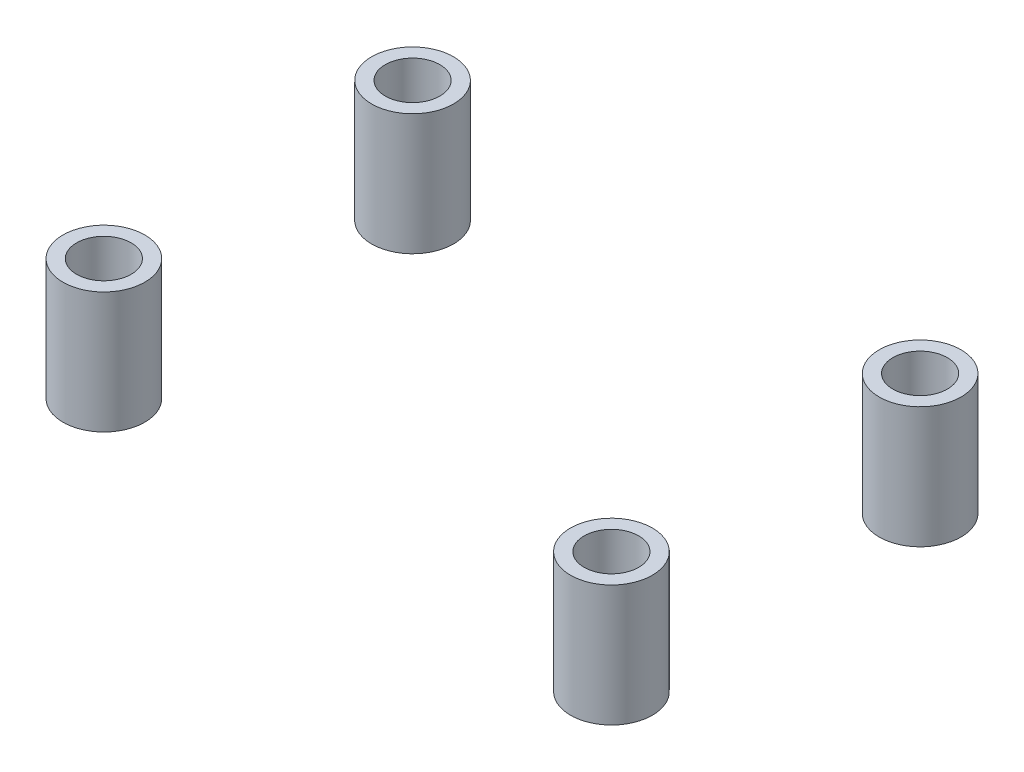
ISO-10303-21;
HEADER;
FILE_DESCRIPTION(('STEP AP214'),'2;1');
FILE_NAME('part.step','',(''),(''),'','','');
FILE_SCHEMA(('AUTOMOTIVE_DESIGN { 1 0 10303 214 1 1 1 1 }'));
ENDSEC;
DATA;
#1=APPLICATION_CONTEXT('core data for automotive mechanical design processes');
#2=APPLICATION_PROTOCOL_DEFINITION('international standard','automotive_design',2000,#1);
#3=PRODUCT_CONTEXT('',#1,'mechanical');
#4=PRODUCT('Part','Part','',(#3));
#5=PRODUCT_RELATED_PRODUCT_CATEGORY('part','',(#4));
#6=PRODUCT_DEFINITION_FORMATION('','',#4);
#7=PRODUCT_DEFINITION_CONTEXT('part definition',#1,'design');
#8=PRODUCT_DEFINITION('design','',#6,#7);
#9=PRODUCT_DEFINITION_SHAPE('','',#8);
#10=(LENGTH_UNIT() NAMED_UNIT(*) SI_UNIT(.MILLI.,.METRE.));
#11=(NAMED_UNIT(*) PLANE_ANGLE_UNIT() SI_UNIT($,.RADIAN.));
#12=(NAMED_UNIT(*) SI_UNIT($,.STERADIAN.) SOLID_ANGLE_UNIT());
#13=UNCERTAINTY_MEASURE_WITH_UNIT(LENGTH_MEASURE(1.E-05),#10,'distance_accuracy_value','');
#14=(GEOMETRIC_REPRESENTATION_CONTEXT(3) GLOBAL_UNCERTAINTY_ASSIGNED_CONTEXT((#13)) GLOBAL_UNIT_ASSIGNED_CONTEXT((#10,
#11,#12)) REPRESENTATION_CONTEXT('',''));
#15=CARTESIAN_POINT('',(0.,0.,0.));
#16=DIRECTION('',(0.,0.,1.));
#17=DIRECTION('',(1.,0.,0.));
#18=AXIS2_PLACEMENT_3D('',#15,#16,#17);
#19=CARTESIAN_POINT('',(18.5995078305466,8.89,11.3123872252951));
#20=DIRECTION('',(0.,-1.,0.));
#21=DIRECTION('',(0.,0.,1.));
#22=AXIS2_PLACEMENT_3D('',#19,#20,#21);
#23=CYLINDRICAL_SURFACE('',#22,3.);
#24=CARTESIAN_POINT('',(18.5995078305466,8.89,11.3123872252951));
#25=DIRECTION('',(0.,1.,0.));
#26=DIRECTION('',(0.,0.,-1.));
#27=AXIS2_PLACEMENT_3D('',#24,#25,#26);
#28=CIRCLE('',#27,3.);
#29=CARTESIAN_POINT('',(18.5995078305466,8.89,8.31238722529509));
#30=VERTEX_POINT('',#29);
#31=EDGE_CURVE('E59',#30,#30,#28,.T.);
#32=ORIENTED_EDGE('',*,*,#31,.F.);
#33=EDGE_LOOP('',(#32));
#34=FACE_BOUND('',#33,.T.);
#35=CARTESIAN_POINT('',(18.5995078305466,0.,11.3123872252951));
#36=DIRECTION('',(0.,1.,0.));
#37=DIRECTION('',(0.,0.,-1.));
#38=AXIS2_PLACEMENT_3D('',#35,#36,#37);
#39=CIRCLE('',#38,3.);
#40=CARTESIAN_POINT('',(18.5995078305466,0.,8.31238722529509));
#41=VERTEX_POINT('',#40);
#42=EDGE_CURVE('E65',#41,#41,#39,.T.);
#43=ORIENTED_EDGE('',*,*,#42,.T.);
#44=EDGE_LOOP('',(#43));
#45=FACE_BOUND('',#44,.T.);
#46=ADVANCED_FACE('F52',(#34,#45),#23,.T.);
#47=CARTESIAN_POINT('',(18.5995078305466,8.89,11.3123872252951));
#48=DIRECTION('',(0.,-1.,0.));
#49=DIRECTION('',(0.,0.,1.));
#50=AXIS2_PLACEMENT_3D('',#47,#48,#49);
#51=CYLINDRICAL_SURFACE('',#50,2.);
#52=CARTESIAN_POINT('',(18.5995078305466,8.89,11.3123872252951));
#53=DIRECTION('',(0.,1.,0.));
#54=DIRECTION('',(0.,0.,-1.));
#55=AXIS2_PLACEMENT_3D('',#52,#53,#54);
#56=CIRCLE('',#55,2.);
#57=CARTESIAN_POINT('',(18.5995078305466,8.89,9.31238722529509));
#58=VERTEX_POINT('',#57);
#59=EDGE_CURVE('E11',#58,#58,#56,.T.);
#60=ORIENTED_EDGE('',*,*,#59,.T.);
#61=EDGE_LOOP('',(#60));
#62=FACE_BOUND('',#61,.T.);
#63=CARTESIAN_POINT('',(18.5995078305466,0.,11.3123872252951));
#64=DIRECTION('',(0.,1.,0.));
#65=DIRECTION('',(0.,0.,-1.));
#66=AXIS2_PLACEMENT_3D('',#63,#64,#65);
#67=CIRCLE('',#66,2.);
#68=CARTESIAN_POINT('',(18.5995078305466,0.,9.31238722529509));
#69=VERTEX_POINT('',#68);
#70=EDGE_CURVE('E55',#69,#69,#67,.T.);
#71=ORIENTED_EDGE('',*,*,#70,.F.);
#72=EDGE_LOOP('',(#71));
#73=FACE_BOUND('',#72,.T.);
#74=ADVANCED_FACE('F74',(#62,#73),#51,.F.);
#75=CARTESIAN_POINT('',(0.,8.89,0.));
#76=DIRECTION('',(0.,1.,0.));
#77=DIRECTION('',(0.,0.,-1.));
#78=AXIS2_PLACEMENT_3D('',#75,#76,#77);
#79=PLANE('',#78);
#80=ORIENTED_EDGE('',*,*,#31,.T.);
#81=EDGE_LOOP('',(#80));
#82=FACE_BOUND('',#81,.T.);
#83=ORIENTED_EDGE('',*,*,#59,.F.);
#84=EDGE_LOOP('',(#83));
#85=FACE_BOUND('',#84,.T.);
#86=ADVANCED_FACE('F76',(#82,#85),#79,.T.);
#87=CARTESIAN_POINT('',(0.,0.,0.));
#88=DIRECTION('',(0.,1.,0.));
#89=DIRECTION('',(0.,0.,-1.));
#90=AXIS2_PLACEMENT_3D('',#87,#88,#89);
#91=PLANE('',#90);
#92=ORIENTED_EDGE('',*,*,#42,.F.);
#93=EDGE_LOOP('',(#92));
#94=FACE_BOUND('',#93,.T.);
#95=ORIENTED_EDGE('',*,*,#70,.T.);
#96=EDGE_LOOP('',(#95));
#97=FACE_BOUND('',#96,.T.);
#98=ADVANCED_FACE('F72',(#94,#97),#91,.F.);
#99=CLOSED_SHELL('',(#46,#74,#86,#98));
#100=MANIFOLD_SOLID_BREP('B2',#99);
#101=CARTESIAN_POINT('',(18.5995078305466,8.89,-11.3123872252951));
#102=DIRECTION('',(0.,-1.,0.));
#103=DIRECTION('',(0.,0.,-1.));
#104=AXIS2_PLACEMENT_3D('',#101,#102,#103);
#105=CYLINDRICAL_SURFACE('',#104,3.);
#106=CARTESIAN_POINT('',(18.5995078305466,8.89,-11.3123872252951));
#107=DIRECTION('',(0.,-1.,0.));
#108=DIRECTION('',(0.,0.,1.));
#109=AXIS2_PLACEMENT_3D('',#106,#107,#108);
#110=CIRCLE('',#109,3.);
#111=CARTESIAN_POINT('',(18.5995078305466,8.89,-8.31238722529509));
#112=VERTEX_POINT('',#111);
#113=EDGE_CURVE('E136',#112,#112,#110,.T.);
#114=ORIENTED_EDGE('',*,*,#113,.T.);
#115=EDGE_LOOP('',(#114));
#116=FACE_BOUND('',#115,.T.);
#117=CARTESIAN_POINT('',(18.5995078305466,0.,-11.3123872252951));
#118=DIRECTION('',(0.,-1.,0.));
#119=DIRECTION('',(0.,0.,1.));
#120=AXIS2_PLACEMENT_3D('',#117,#118,#119);
#121=CIRCLE('',#120,3.);
#122=CARTESIAN_POINT('',(18.5995078305466,0.,-8.31238722529509));
#123=VERTEX_POINT('',#122);
#124=EDGE_CURVE('E143',#123,#123,#121,.T.);
#125=ORIENTED_EDGE('',*,*,#124,.F.);
#126=EDGE_LOOP('',(#125));
#127=FACE_BOUND('',#126,.T.);
#128=ADVANCED_FACE('F128',(#116,#127),#105,.T.);
#129=CARTESIAN_POINT('',(18.5995078305466,8.89,-11.3123872252951));
#130=DIRECTION('',(0.,-1.,0.));
#131=DIRECTION('',(0.,0.,-1.));
#132=AXIS2_PLACEMENT_3D('',#129,#130,#131);
#133=CYLINDRICAL_SURFACE('',#132,2.);
#134=CARTESIAN_POINT('',(18.5995078305466,8.89,-11.3123872252951));
#135=DIRECTION('',(0.,-1.,0.));
#136=DIRECTION('',(0.,0.,1.));
#137=AXIS2_PLACEMENT_3D('',#134,#135,#136);
#138=CIRCLE('',#137,2.);
#139=CARTESIAN_POINT('',(18.5995078305466,8.89,-9.31238722529509));
#140=VERTEX_POINT('',#139);
#141=EDGE_CURVE('E51',#140,#140,#138,.T.);
#142=ORIENTED_EDGE('',*,*,#141,.F.);
#143=EDGE_LOOP('',(#142));
#144=FACE_BOUND('',#143,.T.);
#145=CARTESIAN_POINT('',(18.5995078305466,0.,-11.3123872252951));
#146=DIRECTION('',(0.,-1.,0.));
#147=DIRECTION('',(0.,0.,1.));
#148=AXIS2_PLACEMENT_3D('',#145,#146,#147);
#149=CIRCLE('',#148,2.);
#150=CARTESIAN_POINT('',(18.5995078305466,0.,-9.31238722529509));
#151=VERTEX_POINT('',#150);
#152=EDGE_CURVE('E131',#151,#151,#149,.T.);
#153=ORIENTED_EDGE('',*,*,#152,.T.);
#154=EDGE_LOOP('',(#153));
#155=FACE_BOUND('',#154,.T.);
#156=ADVANCED_FACE('F152',(#144,#155),#133,.F.);
#157=CARTESIAN_POINT('',(0.,8.89,0.));
#158=DIRECTION('',(0.,1.,0.));
#159=DIRECTION('',(0.,0.,1.));
#160=AXIS2_PLACEMENT_3D('',#157,#158,#159);
#161=PLANE('',#160);
#162=ORIENTED_EDGE('',*,*,#113,.F.);
#163=EDGE_LOOP('',(#162));
#164=FACE_BOUND('',#163,.T.);
#165=ORIENTED_EDGE('',*,*,#141,.T.);
#166=EDGE_LOOP('',(#165));
#167=FACE_BOUND('',#166,.T.);
#168=ADVANCED_FACE('F156',(#164,#167),#161,.T.);
#169=CARTESIAN_POINT('',(0.,0.,0.));
#170=DIRECTION('',(0.,1.,0.));
#171=DIRECTION('',(0.,0.,1.));
#172=AXIS2_PLACEMENT_3D('',#169,#170,#171);
#173=PLANE('',#172);
#174=ORIENTED_EDGE('',*,*,#124,.T.);
#175=EDGE_LOOP('',(#174));
#176=FACE_BOUND('',#175,.T.);
#177=ORIENTED_EDGE('',*,*,#152,.F.);
#178=EDGE_LOOP('',(#177));
#179=FACE_BOUND('',#178,.T.);
#180=ADVANCED_FACE('F154',(#176,#179),#173,.F.);
#181=CLOSED_SHELL('',(#128,#156,#168,#180));
#182=MANIFOLD_SOLID_BREP('B6',#181);
#183=CARTESIAN_POINT('',(-18.5995078305466,8.89,11.3123872252951));
#184=DIRECTION('',(0.,-1.,0.));
#185=DIRECTION('',(0.,0.,1.));
#186=AXIS2_PLACEMENT_3D('',#183,#184,#185);
#187=CYLINDRICAL_SURFACE('',#186,3.);
#188=CARTESIAN_POINT('',(-18.5995078305466,8.89,11.3123872252951));
#189=DIRECTION('',(0.,-1.,0.));
#190=DIRECTION('',(0.,0.,-1.));
#191=AXIS2_PLACEMENT_3D('',#188,#189,#190);
#192=CIRCLE('',#191,3.);
#193=CARTESIAN_POINT('',(-18.5995078305466,8.89,8.31238722529509));
#194=VERTEX_POINT('',#193);
#195=EDGE_CURVE('E214',#194,#194,#192,.T.);
#196=ORIENTED_EDGE('',*,*,#195,.T.);
#197=EDGE_LOOP('',(#196));
#198=FACE_BOUND('',#197,.T.);
#199=CARTESIAN_POINT('',(-18.5995078305466,0.,11.3123872252951));
#200=DIRECTION('',(0.,-1.,0.));
#201=DIRECTION('',(0.,0.,-1.));
#202=AXIS2_PLACEMENT_3D('',#199,#200,#201);
#203=CIRCLE('',#202,3.);
#204=CARTESIAN_POINT('',(-18.5995078305466,0.,8.31238722529509));
#205=VERTEX_POINT('',#204);
#206=EDGE_CURVE('E220',#205,#205,#203,.T.);
#207=ORIENTED_EDGE('',*,*,#206,.F.);
#208=EDGE_LOOP('',(#207));
#209=FACE_BOUND('',#208,.T.);
#210=ADVANCED_FACE('F207',(#198,#209),#187,.T.);
#211=CARTESIAN_POINT('',(-18.5995078305466,8.89,11.3123872252951));
#212=DIRECTION('',(0.,-1.,0.));
#213=DIRECTION('',(0.,0.,1.));
#214=AXIS2_PLACEMENT_3D('',#211,#212,#213);
#215=CYLINDRICAL_SURFACE('',#214,2.);
#216=CARTESIAN_POINT('',(-18.5995078305466,8.89,11.3123872252951));
#217=DIRECTION('',(0.,-1.,0.));
#218=DIRECTION('',(0.,0.,-1.));
#219=AXIS2_PLACEMENT_3D('',#216,#217,#218);
#220=CIRCLE('',#219,2.);
#221=CARTESIAN_POINT('',(-18.5995078305466,8.89,9.31238722529509));
#222=VERTEX_POINT('',#221);
#223=EDGE_CURVE('E127',#222,#222,#220,.T.);
#224=ORIENTED_EDGE('',*,*,#223,.F.);
#225=EDGE_LOOP('',(#224));
#226=FACE_BOUND('',#225,.T.);
#227=CARTESIAN_POINT('',(-18.5995078305466,0.,11.3123872252951));
#228=DIRECTION('',(0.,-1.,0.));
#229=DIRECTION('',(0.,0.,-1.));
#230=AXIS2_PLACEMENT_3D('',#227,#228,#229);
#231=CIRCLE('',#230,2.);
#232=CARTESIAN_POINT('',(-18.5995078305466,0.,9.31238722529509));
#233=VERTEX_POINT('',#232);
#234=EDGE_CURVE('E210',#233,#233,#231,.T.);
#235=ORIENTED_EDGE('',*,*,#234,.T.);
#236=EDGE_LOOP('',(#235));
#237=FACE_BOUND('',#236,.T.);
#238=ADVANCED_FACE('F227',(#226,#237),#215,.F.);
#239=CARTESIAN_POINT('',(0.,8.89,0.));
#240=DIRECTION('',(0.,1.,0.));
#241=DIRECTION('',(0.,0.,-1.));
#242=AXIS2_PLACEMENT_3D('',#239,#240,#241);
#243=PLANE('',#242);
#244=ORIENTED_EDGE('',*,*,#195,.F.);
#245=EDGE_LOOP('',(#244));
#246=FACE_BOUND('',#245,.T.);
#247=ORIENTED_EDGE('',*,*,#223,.T.);
#248=EDGE_LOOP('',(#247));
#249=FACE_BOUND('',#248,.T.);
#250=ADVANCED_FACE('F231',(#246,#249),#243,.T.);
#251=CARTESIAN_POINT('',(0.,0.,0.));
#252=DIRECTION('',(0.,1.,0.));
#253=DIRECTION('',(0.,0.,-1.));
#254=AXIS2_PLACEMENT_3D('',#251,#252,#253);
#255=PLANE('',#254);
#256=ORIENTED_EDGE('',*,*,#206,.T.);
#257=EDGE_LOOP('',(#256));
#258=FACE_BOUND('',#257,.T.);
#259=ORIENTED_EDGE('',*,*,#234,.F.);
#260=EDGE_LOOP('',(#259));
#261=FACE_BOUND('',#260,.T.);
#262=ADVANCED_FACE('F229',(#258,#261),#255,.F.);
#263=CLOSED_SHELL('',(#210,#238,#250,#262));
#264=MANIFOLD_SOLID_BREP('B46',#263);
#265=CARTESIAN_POINT('',(-18.5995078305466,8.89,-11.3123872252951));
#266=DIRECTION('',(0.,-1.,0.));
#267=DIRECTION('',(0.,0.,-1.));
#268=AXIS2_PLACEMENT_3D('',#265,#266,#267);
#269=CYLINDRICAL_SURFACE('',#268,3.);
#270=CARTESIAN_POINT('',(-18.5995078305466,8.89,-11.3123872252951));
#271=DIRECTION('',(0.,1.,0.));
#272=DIRECTION('',(0.,0.,1.));
#273=AXIS2_PLACEMENT_3D('',#270,#271,#272);
#274=CIRCLE('',#273,3.);
#275=CARTESIAN_POINT('',(-18.5995078305466,8.89,-8.31238722529509));
#276=VERTEX_POINT('',#275);
#277=EDGE_CURVE('E282',#276,#276,#274,.T.);
#278=ORIENTED_EDGE('',*,*,#277,.F.);
#279=EDGE_LOOP('',(#278));
#280=FACE_BOUND('',#279,.T.);
#281=CARTESIAN_POINT('',(-18.5995078305466,0.,-11.3123872252951));
#282=DIRECTION('',(0.,1.,0.));
#283=DIRECTION('',(0.,0.,1.));
#284=AXIS2_PLACEMENT_3D('',#281,#282,#283);
#285=CIRCLE('',#284,3.);
#286=CARTESIAN_POINT('',(-18.5995078305466,0.,-8.31238722529509));
#287=VERTEX_POINT('',#286);
#288=EDGE_CURVE('E288',#287,#287,#285,.T.);
#289=ORIENTED_EDGE('',*,*,#288,.T.);
#290=EDGE_LOOP('',(#289));
#291=FACE_BOUND('',#290,.T.);
#292=ADVANCED_FACE('F275',(#280,#291),#269,.T.);
#293=CARTESIAN_POINT('',(-18.5995078305466,8.89,-11.3123872252951));
#294=DIRECTION('',(0.,-1.,0.));
#295=DIRECTION('',(0.,0.,-1.));
#296=AXIS2_PLACEMENT_3D('',#293,#294,#295);
#297=CYLINDRICAL_SURFACE('',#296,2.);
#298=CARTESIAN_POINT('',(-18.5995078305466,8.89,-11.3123872252951));
#299=DIRECTION('',(0.,1.,0.));
#300=DIRECTION('',(0.,0.,1.));
#301=AXIS2_PLACEMENT_3D('',#298,#299,#300);
#302=CIRCLE('',#301,2.);
#303=CARTESIAN_POINT('',(-18.5995078305466,8.89,-9.31238722529509));
#304=VERTEX_POINT('',#303);
#305=EDGE_CURVE('E206',#304,#304,#302,.T.);
#306=ORIENTED_EDGE('',*,*,#305,.T.);
#307=EDGE_LOOP('',(#306));
#308=FACE_BOUND('',#307,.T.);
#309=CARTESIAN_POINT('',(-18.5995078305466,0.,-11.3123872252951));
#310=DIRECTION('',(0.,1.,0.));
#311=DIRECTION('',(0.,0.,1.));
#312=AXIS2_PLACEMENT_3D('',#309,#310,#311);
#313=CIRCLE('',#312,2.);
#314=CARTESIAN_POINT('',(-18.5995078305466,0.,-9.31238722529509));
#315=VERTEX_POINT('',#314);
#316=EDGE_CURVE('E278',#315,#315,#313,.T.);
#317=ORIENTED_EDGE('',*,*,#316,.F.);
#318=EDGE_LOOP('',(#317));
#319=FACE_BOUND('',#318,.T.);
#320=ADVANCED_FACE('F297',(#308,#319),#297,.F.);
#321=CARTESIAN_POINT('',(0.,8.89,0.));
#322=DIRECTION('',(0.,1.,0.));
#323=DIRECTION('',(0.,0.,1.));
#324=AXIS2_PLACEMENT_3D('',#321,#322,#323);
#325=PLANE('',#324);
#326=ORIENTED_EDGE('',*,*,#277,.T.);
#327=EDGE_LOOP('',(#326));
#328=FACE_BOUND('',#327,.T.);
#329=ORIENTED_EDGE('',*,*,#305,.F.);
#330=EDGE_LOOP('',(#329));
#331=FACE_BOUND('',#330,.T.);
#332=ADVANCED_FACE('F299',(#328,#331),#325,.T.);
#333=CARTESIAN_POINT('',(0.,0.,0.));
#334=DIRECTION('',(0.,1.,0.));
#335=DIRECTION('',(0.,0.,1.));
#336=AXIS2_PLACEMENT_3D('',#333,#334,#335);
#337=PLANE('',#336);
#338=ORIENTED_EDGE('',*,*,#288,.F.);
#339=EDGE_LOOP('',(#338));
#340=FACE_BOUND('',#339,.T.);
#341=ORIENTED_EDGE('',*,*,#316,.T.);
#342=EDGE_LOOP('',(#341));
#343=FACE_BOUND('',#342,.T.);
#344=ADVANCED_FACE('F295',(#340,#343),#337,.F.);
#345=CLOSED_SHELL('',(#292,#320,#332,#344));
#346=MANIFOLD_SOLID_BREP('B122',#345);
#347=ADVANCED_BREP_SHAPE_REPRESENTATION('',(#18,#100,#182,#264,#346),#14);
#348=SHAPE_DEFINITION_REPRESENTATION(#9,#347);
ENDSEC;
END-ISO-10303-21;
